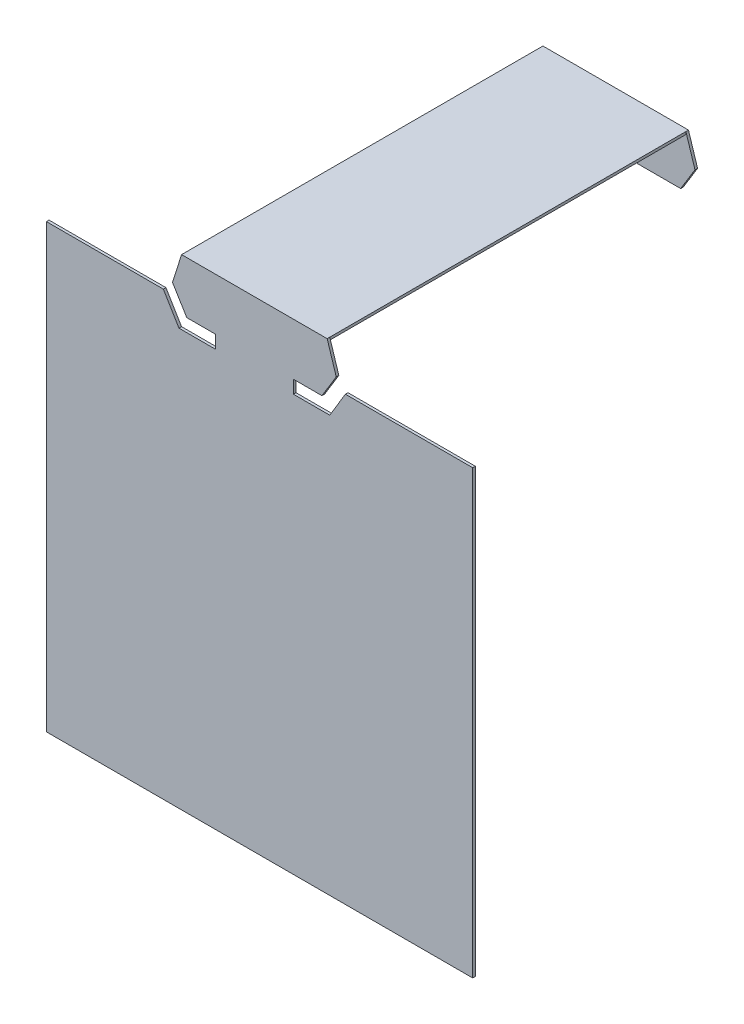
ISO-10303-21;
HEADER;
FILE_DESCRIPTION(('STEP AP214'),'2;1');
FILE_NAME('part.step','',(''),(''),'','','');
FILE_SCHEMA(('AUTOMOTIVE_DESIGN { 1 0 10303 214 1 1 1 1 }'));
ENDSEC;
DATA;
#1=APPLICATION_CONTEXT('core data for automotive mechanical design processes');
#2=APPLICATION_PROTOCOL_DEFINITION('international standard','automotive_design',2000,#1);
#3=PRODUCT_CONTEXT('',#1,'mechanical');
#4=PRODUCT('Part','Part','',(#3));
#5=PRODUCT_RELATED_PRODUCT_CATEGORY('part','',(#4));
#6=PRODUCT_DEFINITION_FORMATION('','',#4);
#7=PRODUCT_DEFINITION_CONTEXT('part definition',#1,'design');
#8=PRODUCT_DEFINITION('design','',#6,#7);
#9=PRODUCT_DEFINITION_SHAPE('','',#8);
#10=(LENGTH_UNIT() NAMED_UNIT(*) SI_UNIT(.MILLI.,.METRE.));
#11=(NAMED_UNIT(*) PLANE_ANGLE_UNIT() SI_UNIT($,.RADIAN.));
#12=(NAMED_UNIT(*) SI_UNIT($,.STERADIAN.) SOLID_ANGLE_UNIT());
#13=UNCERTAINTY_MEASURE_WITH_UNIT(LENGTH_MEASURE(1.E-05),#10,'distance_accuracy_value','');
#14=(GEOMETRIC_REPRESENTATION_CONTEXT(3) GLOBAL_UNCERTAINTY_ASSIGNED_CONTEXT((#13)) GLOBAL_UNIT_ASSIGNED_CONTEXT((#10,
#11,#12)) REPRESENTATION_CONTEXT('',''));
#15=CARTESIAN_POINT('',(0.,0.,0.));
#16=DIRECTION('',(0.,0.,1.));
#17=DIRECTION('',(1.,0.,0.));
#18=AXIS2_PLACEMENT_3D('',#15,#16,#17);
#19=CARTESIAN_POINT('',(-0.3048,2.54,-3.5306));
#20=DIRECTION('',(0.,0.,1.));
#21=DIRECTION('',(1.,0.,0.));
#22=AXIS2_PLACEMENT_3D('',#19,#20,#21);
#23=PLANE('',#22);
#24=DIRECTION('',(0.521450009454707,0.853281833651512,0.));
#25=VECTOR('',#24,1.);
#26=CARTESIAN_POINT('',(0.42545,2.4003,-3.5306));
#27=LINE('',#26,#25);
#28=CARTESIAN_POINT('',(0.355599999999975,2.28600000000001,-3.5306));
#29=VERTEX_POINT('',#28);
#30=CARTESIAN_POINT('',(0.495300000000043,2.51459999999997,-3.5306));
#31=VERTEX_POINT('',#30);
#32=EDGE_CURVE('E214',#29,#31,#27,.T.);
#33=ORIENTED_EDGE('',*,*,#32,.F.);
#34=DIRECTION('',(1.,0.,0.));
#35=VECTOR('',#34,1.);
#36=CARTESIAN_POINT('',(-0.3048,2.286,-3.5306));
#37=LINE('',#36,#35);
#38=CARTESIAN_POINT('',(-0.965199999999975,2.28600000000001,-3.5306));
#39=VERTEX_POINT('',#38);
#40=EDGE_CURVE('E186',#29,#39,#37,.F.);
#41=ORIENTED_EDGE('',*,*,#40,.T.);
#42=DIRECTION('',(-0.521450009454707,0.853281833651512,0.));
#43=VECTOR('',#42,1.);
#44=CARTESIAN_POINT('',(-1.03505,2.4003,-3.5306));
#45=LINE('',#44,#43);
#46=CARTESIAN_POINT('',(-1.10490000000002,2.51459999999998,-3.5306));
#47=VERTEX_POINT('',#46);
#48=EDGE_CURVE('E188',#39,#47,#45,.T.);
#49=ORIENTED_EDGE('',*,*,#48,.T.);
#50=DIRECTION('',(0.303203657275205,0.952925780013816,0.));
#51=VECTOR('',#50,1.);
#52=CARTESIAN_POINT('',(-1.06045000000025,2.6543,-3.5306));
#53=LINE('',#52,#51);
#54=CARTESIAN_POINT('',(-1.01600000000032,2.79400000000002,-3.5306));
#55=VERTEX_POINT('',#54);
#56=EDGE_CURVE('E19',#47,#55,#53,.T.);
#57=ORIENTED_EDGE('',*,*,#56,.T.);
#58=DIRECTION('',(1.,0.,0.));
#59=VECTOR('',#58,1.);
#60=CARTESIAN_POINT('',(-0.3048,2.794,-3.5306));
#61=LINE('',#60,#59);
#62=CARTESIAN_POINT('',(0.406400000000382,2.79400000000004,-3.5306));
#63=VERTEX_POINT('',#62);
#64=EDGE_CURVE('E232',#63,#55,#61,.F.);
#65=ORIENTED_EDGE('',*,*,#64,.F.);
#66=DIRECTION('',(-0.303203657275205,0.952925780013816,0.));
#67=VECTOR('',#66,1.);
#68=CARTESIAN_POINT('',(0.450850000000254,2.6543,-3.5306));
#69=LINE('',#68,#67);
#70=EDGE_CURVE('E219',#31,#63,#69,.T.);
#71=ORIENTED_EDGE('',*,*,#70,.F.);
#72=EDGE_LOOP('',(#33,#41,#49,#57,#65,#71));
#73=FACE_BOUND('',#72,.T.);
#74=ADVANCED_FACE('F16',(#73),#23,.F.);
#75=CARTESIAN_POINT('',(-1.06045000000025,2.6543,-3.5179));
#76=DIRECTION('',(0.952925780013816,-0.303203657275205,0.));
#77=DIRECTION('',(0.303203657275205,0.952925780013816,0.));
#78=AXIS2_PLACEMENT_3D('',#75,#76,#77);
#79=PLANE('',#78);
#80=DIRECTION('',(0.,0.,1.));
#81=VECTOR('',#80,1.);
#82=CARTESIAN_POINT('',(-1.1049000000001,2.51459999999994,-3.5179));
#83=LINE('',#82,#81);
#84=CARTESIAN_POINT('',(-1.10490000000001,2.51459999999998,-3.5052));
#85=VERTEX_POINT('',#84);
#86=EDGE_CURVE('E195',#47,#85,#83,.T.);
#87=ORIENTED_EDGE('',*,*,#86,.T.);
#88=DIRECTION('',(-0.303203657276159,-0.952925780013513,0.));
#89=VECTOR('',#88,1.);
#90=CARTESIAN_POINT('',(-1.01600000000025,2.794,-3.5052));
#91=LINE('',#90,#89);
#92=CARTESIAN_POINT('',(-1.01600000000029,2.79400000000024,-3.5052));
#93=VERTEX_POINT('',#92);
#94=EDGE_CURVE('E235',#93,#85,#91,.T.);
#95=ORIENTED_EDGE('',*,*,#94,.F.);
#96=DIRECTION('',(0.,0.,1.));
#97=VECTOR('',#96,1.);
#98=CARTESIAN_POINT('',(-1.01600000000025,2.794,-1.7653));
#99=LINE('',#98,#97);
#100=EDGE_CURVE('E200',#55,#93,#99,.T.);
#101=ORIENTED_EDGE('',*,*,#100,.F.);
#102=ORIENTED_EDGE('',*,*,#56,.F.);
#103=EDGE_LOOP('',(#87,#95,#101,#102));
#104=FACE_BOUND('',#103,.T.);
#105=ADVANCED_FACE('F197',(#104),#79,.F.);
#106=CARTESIAN_POINT('',(-1.03505,2.4003,-3.5179));
#107=DIRECTION('',(0.853281833651512,0.521450009454707,0.));
#108=DIRECTION('',(-0.521450009454707,0.853281833651512,0.));
#109=AXIS2_PLACEMENT_3D('',#106,#107,#108);
#110=PLANE('',#109);
#111=DIRECTION('',(0.521450009453974,-0.85328183365196,0.));
#112=VECTOR('',#111,1.);
#113=CARTESIAN_POINT('',(-1.1049,2.5146,-3.5052));
#114=LINE('',#113,#112);
#115=CARTESIAN_POINT('',(-0.965199999999951,2.28600000000003,-3.5052));
#116=VERTEX_POINT('',#115);
#117=EDGE_CURVE('E204',#85,#116,#114,.T.);
#118=ORIENTED_EDGE('',*,*,#117,.F.);
#119=ORIENTED_EDGE('',*,*,#86,.F.);
#120=ORIENTED_EDGE('',*,*,#48,.F.);
#121=DIRECTION('',(0.,0.,1.));
#122=VECTOR('',#121,1.);
#123=CARTESIAN_POINT('',(-0.9652,2.286,-3.5179));
#124=LINE('',#123,#122);
#125=EDGE_CURVE('E207',#39,#116,#124,.T.);
#126=ORIENTED_EDGE('',*,*,#125,.T.);
#127=EDGE_LOOP('',(#118,#119,#120,#126));
#128=FACE_BOUND('',#127,.T.);
#129=ADVANCED_FACE('F202',(#128),#110,.F.);
#130=CARTESIAN_POINT('',(-0.3048,2.286,-3.5179));
#131=DIRECTION('',(0.,1.,0.));
#132=DIRECTION('',(0.,0.,1.));
#133=AXIS2_PLACEMENT_3D('',#130,#131,#132);
#134=PLANE('',#133);
#135=DIRECTION('',(1.,0.,0.));
#136=VECTOR('',#135,1.);
#137=CARTESIAN_POINT('',(-0.3048,2.286,-3.5052));
#138=LINE('',#137,#136);
#139=CARTESIAN_POINT('',(0.355599999999975,2.28600000000001,-3.5052));
#140=VERTEX_POINT('',#139);
#141=EDGE_CURVE('E238',#116,#140,#138,.T.);
#142=ORIENTED_EDGE('',*,*,#141,.F.);
#143=ORIENTED_EDGE('',*,*,#125,.F.);
#144=ORIENTED_EDGE('',*,*,#40,.F.);
#145=DIRECTION('',(0.,0.,1.));
#146=VECTOR('',#145,1.);
#147=CARTESIAN_POINT('',(0.355599999999902,2.28600000000006,-3.5179));
#148=LINE('',#147,#146);
#149=EDGE_CURVE('E211',#140,#29,#148,.F.);
#150=ORIENTED_EDGE('',*,*,#149,.F.);
#151=EDGE_LOOP('',(#142,#143,#144,#150));
#152=FACE_BOUND('',#151,.T.);
#153=ADVANCED_FACE('F697',(#152),#134,.F.);
#154=CARTESIAN_POINT('',(0.42545,2.4003,-3.5179));
#155=DIRECTION('',(0.853281833651512,-0.521450009454707,0.));
#156=DIRECTION('',(0.521450009454707,0.853281833651512,0.));
#157=AXIS2_PLACEMENT_3D('',#154,#155,#156);
#158=PLANE('',#157);
#159=ORIENTED_EDGE('',*,*,#149,.T.);
#160=ORIENTED_EDGE('',*,*,#32,.T.);
#161=DIRECTION('',(0.,0.,1.));
#162=VECTOR('',#161,1.);
#163=CARTESIAN_POINT('',(0.495299999999975,2.51459999999999,-3.5179));
#164=LINE('',#163,#162);
#165=CARTESIAN_POINT('',(0.495300000000043,2.51459999999997,-3.5052));
#166=VERTEX_POINT('',#165);
#167=EDGE_CURVE('E216',#166,#31,#164,.F.);
#168=ORIENTED_EDGE('',*,*,#167,.F.);
#169=DIRECTION('',(0.521450009453974,0.853281833651959,0.));
#170=VECTOR('',#169,1.);
#171=CARTESIAN_POINT('',(0.3556,2.286,-3.5052));
#172=LINE('',#171,#170);
#173=EDGE_CURVE('E241',#140,#166,#172,.T.);
#174=ORIENTED_EDGE('',*,*,#173,.F.);
#175=EDGE_LOOP('',(#159,#160,#168,#174));
#176=FACE_BOUND('',#175,.T.);
#177=ADVANCED_FACE('F687',(#176),#158,.T.);
#178=CARTESIAN_POINT('',(0.450850000000254,2.6543,-3.5179));
#179=DIRECTION('',(0.952925780013816,0.303203657275205,0.));
#180=DIRECTION('',(-0.303203657275205,0.952925780013816,0.));
#181=AXIS2_PLACEMENT_3D('',#178,#179,#180);
#182=PLANE('',#181);
#183=ORIENTED_EDGE('',*,*,#70,.T.);
#184=DIRECTION('',(0.,0.,1.));
#185=VECTOR('',#184,1.);
#186=CARTESIAN_POINT('',(0.406400000000254,2.794,-1.7653));
#187=LINE('',#186,#185);
#188=CARTESIAN_POINT('',(0.40640000000035,2.79400000000004,-3.5052));
#189=VERTEX_POINT('',#188);
#190=EDGE_CURVE('E229',#189,#63,#187,.F.);
#191=ORIENTED_EDGE('',*,*,#190,.F.);
#192=DIRECTION('',(-0.30320365727616,0.952925780013512,0.));
#193=VECTOR('',#192,1.);
#194=CARTESIAN_POINT('',(0.4953,2.5146,-3.5052));
#195=LINE('',#194,#193);
#196=EDGE_CURVE('E244',#166,#189,#195,.T.);
#197=ORIENTED_EDGE('',*,*,#196,.F.);
#198=ORIENTED_EDGE('',*,*,#167,.T.);
#199=EDGE_LOOP('',(#183,#191,#197,#198));
#200=FACE_BOUND('',#199,.T.);
#201=ADVANCED_FACE('F678',(#200),#182,.T.);
#202=CARTESIAN_POINT('',(-0.3048,2.794,-1.7653));
#203=DIRECTION('',(0.,1.,0.));
#204=DIRECTION('',(0.,0.,1.));
#205=AXIS2_PLACEMENT_3D('',#202,#203,#204);
#206=PLANE('',#205);
#207=ORIENTED_EDGE('',*,*,#64,.T.);
#208=ORIENTED_EDGE('',*,*,#100,.T.);
#209=DIRECTION('',(0.,0.,-1.));
#210=VECTOR('',#209,1.);
#211=CARTESIAN_POINT('',(-1.016,2.794,-1.7653));
#212=LINE('',#211,#210);
#213=CARTESIAN_POINT('',(-1.01600000000019,2.79400000000011,-0.0254000000000001));
#214=VERTEX_POINT('',#213);
#215=EDGE_CURVE('E250',#93,#214,#212,.F.);
#216=ORIENTED_EDGE('',*,*,#215,.T.);
#217=DIRECTION('',(0.,0.,1.));
#218=VECTOR('',#217,1.);
#219=CARTESIAN_POINT('',(-1.01600000000025,2.794,-1.7653));
#220=LINE('',#219,#218);
#221=CARTESIAN_POINT('',(-1.01600000000032,2.79400000000002,0.));
#222=VERTEX_POINT('',#221);
#223=EDGE_CURVE('E221',#214,#222,#220,.T.);
#224=ORIENTED_EDGE('',*,*,#223,.T.);
#225=DIRECTION('',(1.,0.,0.));
#226=VECTOR('',#225,1.);
#227=CARTESIAN_POINT('',(-0.3048,2.794,0.));
#228=LINE('',#227,#226);
#229=CARTESIAN_POINT('',(0.406400000000312,2.79400000000004,0.));
#230=VERTEX_POINT('',#229);
#231=EDGE_CURVE('E224',#222,#230,#228,.T.);
#232=ORIENTED_EDGE('',*,*,#231,.T.);
#233=DIRECTION('',(0.,0.,1.));
#234=VECTOR('',#233,1.);
#235=CARTESIAN_POINT('',(0.406400000000254,2.794,-1.7653));
#236=LINE('',#235,#234);
#237=CARTESIAN_POINT('',(0.406400000000061,2.79400000000002,-0.0254000000000001));
#238=VERTEX_POINT('',#237);
#239=EDGE_CURVE('E227',#230,#238,#236,.F.);
#240=ORIENTED_EDGE('',*,*,#239,.T.);
#241=DIRECTION('',(0.,0.,-1.));
#242=VECTOR('',#241,1.);
#243=CARTESIAN_POINT('',(0.4064,2.794,-1.7653));
#244=LINE('',#243,#242);
#245=EDGE_CURVE('E255',#189,#238,#244,.F.);
#246=ORIENTED_EDGE('',*,*,#245,.F.);
#247=ORIENTED_EDGE('',*,*,#190,.T.);
#248=EDGE_LOOP('',(#207,#208,#216,#224,#232,#240,#246,#247));
#249=FACE_BOUND('',#248,.T.);
#250=ADVANCED_FACE('F463',(#249),#206,.T.);
#251=CARTESIAN_POINT('',(-0.3048,2.54,-3.5052));
#252=DIRECTION('',(0.,0.,1.));
#253=DIRECTION('',(1.,0.,0.));
#254=AXIS2_PLACEMENT_3D('',#251,#252,#253);
#255=PLANE('',#254);
#256=DIRECTION('',(0.,1.,0.));
#257=VECTOR('',#256,1.);
#258=CARTESIAN_POINT('',(0.4064,2.7813,-3.5052));
#259=LINE('',#258,#257);
#260=CARTESIAN_POINT('',(0.406400000000127,2.7686,-3.5052));
#261=VERTEX_POINT('',#260);
#262=EDGE_CURVE('E260',#261,#189,#259,.T.);
#263=ORIENTED_EDGE('',*,*,#262,.F.);
#264=DIRECTION('',(1.,0.,0.));
#265=VECTOR('',#264,1.);
#266=CARTESIAN_POINT('',(-0.3048,2.7686,-3.5052));
#267=LINE('',#266,#265);
#268=CARTESIAN_POINT('',(-1.016,2.7686,-3.5052));
#269=VERTEX_POINT('',#268);
#270=EDGE_CURVE('E263',#261,#269,#267,.F.);
#271=ORIENTED_EDGE('',*,*,#270,.T.);
#272=DIRECTION('',(0.,1.,0.));
#273=VECTOR('',#272,1.);
#274=CARTESIAN_POINT('',(-1.016,2.7813,-3.5052));
#275=LINE('',#274,#273);
#276=EDGE_CURVE('E247',#269,#93,#275,.T.);
#277=ORIENTED_EDGE('',*,*,#276,.T.);
#278=ORIENTED_EDGE('',*,*,#94,.T.);
#279=ORIENTED_EDGE('',*,*,#117,.T.);
#280=ORIENTED_EDGE('',*,*,#141,.T.);
#281=ORIENTED_EDGE('',*,*,#173,.T.);
#282=ORIENTED_EDGE('',*,*,#196,.T.);
#283=EDGE_LOOP('',(#263,#271,#277,#278,#279,#280,#281,#282));
#284=FACE_BOUND('',#283,.T.);
#285=ADVANCED_FACE('F474',(#284),#255,.T.);
#286=CARTESIAN_POINT('',(-1.016,2.7813,-1.7653));
#287=DIRECTION('',(1.,0.,0.));
#288=DIRECTION('',(0.,0.,-1.));
#289=AXIS2_PLACEMENT_3D('',#286,#287,#288);
#290=PLANE('',#289);
#291=DIRECTION('',(0.,1.,0.));
#292=VECTOR('',#291,1.);
#293=CARTESIAN_POINT('',(-1.016,2.7813,-0.0254000000000001));
#294=LINE('',#293,#292);
#295=CARTESIAN_POINT('',(-1.016,2.7686,-0.0254000000000001));
#296=VERTEX_POINT('',#295);
#297=EDGE_CURVE('E253',#214,#296,#294,.F.);
#298=ORIENTED_EDGE('',*,*,#297,.F.);
#299=ORIENTED_EDGE('',*,*,#215,.F.);
#300=ORIENTED_EDGE('',*,*,#276,.F.);
#301=DIRECTION('',(0.,0.,1.));
#302=VECTOR('',#301,1.);
#303=CARTESIAN_POINT('',(-1.016,2.7686,-1.7653));
#304=LINE('',#303,#302);
#305=EDGE_CURVE('E265',#269,#296,#304,.T.);
#306=ORIENTED_EDGE('',*,*,#305,.T.);
#307=EDGE_LOOP('',(#298,#299,#300,#306));
#308=FACE_BOUND('',#307,.T.);
#309=ADVANCED_FACE('F478',(#308),#290,.F.);
#310=CARTESIAN_POINT('',(0.4064,2.7813,-1.7653));
#311=DIRECTION('',(1.,0.,0.));
#312=DIRECTION('',(0.,0.,-1.));
#313=AXIS2_PLACEMENT_3D('',#310,#311,#312);
#314=PLANE('',#313);
#315=DIRECTION('',(0.,0.,1.));
#316=VECTOR('',#315,1.);
#317=CARTESIAN_POINT('',(0.4064,2.7686,-1.7653));
#318=LINE('',#317,#316);
#319=CARTESIAN_POINT('',(0.4064,2.7686,-0.0254000000000001));
#320=VERTEX_POINT('',#319);
#321=EDGE_CURVE('E268',#320,#261,#318,.F.);
#322=ORIENTED_EDGE('',*,*,#321,.T.);
#323=ORIENTED_EDGE('',*,*,#262,.T.);
#324=ORIENTED_EDGE('',*,*,#245,.T.);
#325=DIRECTION('',(0.,1.,0.));
#326=VECTOR('',#325,1.);
#327=CARTESIAN_POINT('',(0.4064,2.7813,-0.0254000000000001));
#328=LINE('',#327,#326);
#329=EDGE_CURVE('E258',#238,#320,#328,.F.);
#330=ORIENTED_EDGE('',*,*,#329,.T.);
#331=EDGE_LOOP('',(#322,#323,#324,#330));
#332=FACE_BOUND('',#331,.T.);
#333=ADVANCED_FACE('F467',(#332),#314,.T.);
#334=CARTESIAN_POINT('',(-0.3048,2.7686,-1.7653));
#335=DIRECTION('',(0.,1.,0.));
#336=DIRECTION('',(0.,0.,1.));
#337=AXIS2_PLACEMENT_3D('',#334,#335,#336);
#338=PLANE('',#337);
#339=DIRECTION('',(1.,0.,0.));
#340=VECTOR('',#339,1.);
#341=CARTESIAN_POINT('',(-0.254,2.7686,-0.0254));
#342=LINE('',#341,#340);
#343=EDGE_CURVE('E271',#320,#296,#342,.F.);
#344=ORIENTED_EDGE('',*,*,#343,.T.);
#345=ORIENTED_EDGE('',*,*,#305,.F.);
#346=ORIENTED_EDGE('',*,*,#270,.F.);
#347=ORIENTED_EDGE('',*,*,#321,.F.);
#348=EDGE_LOOP('',(#344,#345,#346,#347));
#349=FACE_BOUND('',#348,.T.);
#350=ADVANCED_FACE('F470',(#349),#338,.F.);
#351=CARTESIAN_POINT('',(-0.254,0.4445,-0.0254));
#352=DIRECTION('',(0.,0.,1.));
#353=DIRECTION('',(1.,0.,0.));
#354=AXIS2_PLACEMENT_3D('',#351,#352,#353);
#355=PLANE('',#354);
#356=DIRECTION('',(-0.303203657276947,0.952925780013262,0.));
#357=VECTOR('',#356,1.);
#358=CARTESIAN_POINT('',(0.4953,2.5146,-0.0254));
#359=LINE('',#358,#357);
#360=CARTESIAN_POINT('',(0.495300000000018,2.51459999999998,-0.0254));
#361=VERTEX_POINT('',#360);
#362=EDGE_CURVE('E296',#361,#238,#359,.T.);
#363=ORIENTED_EDGE('',*,*,#362,.F.);
#364=DIRECTION('',(0.521450009453974,0.853281833651959,0.));
#365=VECTOR('',#364,1.);
#366=CARTESIAN_POINT('',(0.3556,2.286,-0.0254));
#367=LINE('',#366,#365);
#368=CARTESIAN_POINT('',(0.355599999999975,2.28600000000001,-0.0254));
#369=VERTEX_POINT('',#368);
#370=EDGE_CURVE('E294',#369,#361,#367,.T.);
#371=ORIENTED_EDGE('',*,*,#370,.F.);
#372=DIRECTION('',(1.,0.,0.));
#373=VECTOR('',#372,1.);
#374=CARTESIAN_POINT('',(-0.254,2.286,-0.0254));
#375=LINE('',#374,#373);
#376=CARTESIAN_POINT('',(0.0762,2.286,-0.0254));
#377=VERTEX_POINT('',#376);
#378=EDGE_CURVE('E292',#377,#369,#375,.T.);
#379=ORIENTED_EDGE('',*,*,#378,.F.);
#380=DIRECTION('',(0.,1.,0.));
#381=VECTOR('',#380,1.);
#382=CARTESIAN_POINT('',(0.0762,0.4445,-0.0254));
#383=LINE('',#382,#381);
#384=CARTESIAN_POINT('',(0.0762,2.159,-0.0254));
#385=VERTEX_POINT('',#384);
#386=EDGE_CURVE('E290',#385,#377,#383,.T.);
#387=ORIENTED_EDGE('',*,*,#386,.F.);
#388=DIRECTION('',(1.,0.,0.));
#389=VECTOR('',#388,1.);
#390=CARTESIAN_POINT('',(-0.254,2.159,-0.0254));
#391=LINE('',#390,#389);
#392=CARTESIAN_POINT('',(0.431800000000009,2.15899999999999,-0.0254));
#393=VERTEX_POINT('',#392);
#394=EDGE_CURVE('E288',#393,#385,#391,.F.);
#395=ORIENTED_EDGE('',*,*,#394,.F.);
#396=DIRECTION('',(-0.514495755427527,-0.857492925712544,0.));
#397=VECTOR('',#396,1.);
#398=CARTESIAN_POINT('',(0.5842,2.413,-0.0254));
#399=LINE('',#398,#397);
#400=CARTESIAN_POINT('',(0.584199999999991,2.41300000000001,-0.0254));
#401=VERTEX_POINT('',#400);
#402=EDGE_CURVE('E286',#401,#393,#399,.T.);
#403=ORIENTED_EDGE('',*,*,#402,.F.);
#404=DIRECTION('',(1.,0.,0.));
#405=VECTOR('',#404,1.);
#406=CARTESIAN_POINT('',(-0.254,2.413,-0.0254));
#407=LINE('',#406,#405);
#408=CARTESIAN_POINT('',(1.8288,2.413,-0.0254));
#409=VERTEX_POINT('',#408);
#410=EDGE_CURVE('E284',#409,#401,#407,.F.);
#411=ORIENTED_EDGE('',*,*,#410,.F.);
#412=DIRECTION('',(0.,1.,0.));
#413=VECTOR('',#412,1.);
#414=CARTESIAN_POINT('',(1.8288,0.254,-0.0254));
#415=LINE('',#414,#413);
#416=CARTESIAN_POINT('',(1.8288,-1.905,-0.0254));
#417=VERTEX_POINT('',#416);
#418=EDGE_CURVE('E318',#417,#409,#415,.T.);
#419=ORIENTED_EDGE('',*,*,#418,.F.);
#420=DIRECTION('',(1.,0.,0.));
#421=VECTOR('',#420,1.);
#422=CARTESIAN_POINT('',(-0.254,-1.905,-0.0254));
#423=LINE('',#422,#421);
#424=CARTESIAN_POINT('',(-2.3368,-1.905,-0.0254));
#425=VERTEX_POINT('',#424);
#426=EDGE_CURVE('E311',#417,#425,#423,.F.);
#427=ORIENTED_EDGE('',*,*,#426,.T.);
#428=DIRECTION('',(0.,1.,0.));
#429=VECTOR('',#428,1.);
#430=CARTESIAN_POINT('',(-2.3368,0.254,-0.0254));
#431=LINE('',#430,#429);
#432=CARTESIAN_POINT('',(-2.3368,2.413,-0.0254));
#433=VERTEX_POINT('',#432);
#434=EDGE_CURVE('E307',#425,#433,#431,.T.);
#435=ORIENTED_EDGE('',*,*,#434,.T.);
#436=DIRECTION('',(1.,0.,0.));
#437=VECTOR('',#436,1.);
#438=CARTESIAN_POINT('',(-1.7653,2.413,-0.0254));
#439=LINE('',#438,#437);
#440=CARTESIAN_POINT('',(-1.19379999999998,2.41300000000001,-0.0254));
#441=VERTEX_POINT('',#440);
#442=EDGE_CURVE('E304',#441,#433,#439,.F.);
#443=ORIENTED_EDGE('',*,*,#442,.F.);
#444=DIRECTION('',(-0.514495755427291,0.857492925712685,0.));
#445=VECTOR('',#444,1.);
#446=CARTESIAN_POINT('',(-1.1176,2.286,-0.0254));
#447=LINE('',#446,#445);
#448=CARTESIAN_POINT('',(-1.04140000000001,2.15899999999999,-0.0254));
#449=VERTEX_POINT('',#448);
#450=EDGE_CURVE('E299',#449,#441,#447,.T.);
#451=ORIENTED_EDGE('',*,*,#450,.F.);
#452=DIRECTION('',(1.,0.,0.));
#453=VECTOR('',#452,1.);
#454=CARTESIAN_POINT('',(-0.254,2.159,-0.0254));
#455=LINE('',#454,#453);
#456=CARTESIAN_POINT('',(-0.6858,2.159,-0.0254));
#457=VERTEX_POINT('',#456);
#458=EDGE_CURVE('E282',#457,#449,#455,.F.);
#459=ORIENTED_EDGE('',*,*,#458,.F.);
#460=DIRECTION('',(0.,1.,0.));
#461=VECTOR('',#460,1.);
#462=CARTESIAN_POINT('',(-0.6858,0.4445,-0.0254));
#463=LINE('',#462,#461);
#464=CARTESIAN_POINT('',(-0.6858,2.286,-0.0254));
#465=VERTEX_POINT('',#464);
#466=EDGE_CURVE('E280',#465,#457,#463,.F.);
#467=ORIENTED_EDGE('',*,*,#466,.F.);
#468=DIRECTION('',(1.,0.,0.));
#469=VECTOR('',#468,1.);
#470=CARTESIAN_POINT('',(-0.254,2.286,-0.0254));
#471=LINE('',#470,#469);
#472=CARTESIAN_POINT('',(-0.965199999999975,2.28600000000001,-0.0254));
#473=VERTEX_POINT('',#472);
#474=EDGE_CURVE('E278',#473,#465,#471,.T.);
#475=ORIENTED_EDGE('',*,*,#474,.F.);
#476=DIRECTION('',(0.521450009453974,-0.85328183365196,0.));
#477=VECTOR('',#476,1.);
#478=CARTESIAN_POINT('',(-1.1049,2.5146,-0.0254));
#479=LINE('',#478,#477);
#480=CARTESIAN_POINT('',(-1.10490000000002,2.51459999999998,-0.0254));
#481=VERTEX_POINT('',#480);
#482=EDGE_CURVE('E276',#481,#473,#479,.T.);
#483=ORIENTED_EDGE('',*,*,#482,.F.);
#484=DIRECTION('',(-0.303203657276159,-0.952925780013513,0.));
#485=VECTOR('',#484,1.);
#486=CARTESIAN_POINT('',(-1.01600000000025,2.794,-0.0254));
#487=LINE('',#486,#485);
#488=EDGE_CURVE('E274',#214,#481,#487,.T.);
#489=ORIENTED_EDGE('',*,*,#488,.F.);
#490=ORIENTED_EDGE('',*,*,#297,.T.);
#491=ORIENTED_EDGE('',*,*,#343,.F.);
#492=ORIENTED_EDGE('',*,*,#329,.F.);
#493=EDGE_LOOP('',(#363,#371,#379,#387,#395,#403,#411,#419,#427,#435,#443,#451,#459,#467,#475,
#483,#489,#490,#491,#492));
#494=FACE_BOUND('',#493,.T.);
#495=ADVANCED_FACE('F407',(#494),#355,.F.);
#496=CARTESIAN_POINT('',(-1.1176,2.286,-0.0127));
#497=DIRECTION('',(0.857492925712685,0.514495755427291,0.));
#498=DIRECTION('',(-0.514495755427291,0.857492925712685,0.));
#499=AXIS2_PLACEMENT_3D('',#496,#497,#498);
#500=PLANE('',#499);
#501=DIRECTION('',(0.,0.,1.));
#502=VECTOR('',#501,1.);
#503=CARTESIAN_POINT('',(-1.1938,2.413,-0.0127));
#504=LINE('',#503,#502);
#505=CARTESIAN_POINT('',(-1.19379999999998,2.41300000000001,0.));
#506=VERTEX_POINT('',#505);
#507=EDGE_CURVE('E301',#506,#441,#504,.F.);
#508=ORIENTED_EDGE('',*,*,#507,.F.);
#509=DIRECTION('',(-0.514495755427528,0.857492925712543,0.));
#510=VECTOR('',#509,1.);
#511=CARTESIAN_POINT('',(-1.0414,2.159,0.));
#512=LINE('',#511,#510);
#513=CARTESIAN_POINT('',(-1.04140000000002,2.15899999999999,0.));
#514=VERTEX_POINT('',#513);
#515=EDGE_CURVE('E350',#514,#506,#512,.T.);
#516=ORIENTED_EDGE('',*,*,#515,.F.);
#517=DIRECTION('',(0.,0.,1.));
#518=VECTOR('',#517,1.);
#519=CARTESIAN_POINT('',(-1.0414,2.159,-0.0127));
#520=LINE('',#519,#518);
#521=EDGE_CURVE('E346',#449,#514,#520,.T.);
#522=ORIENTED_EDGE('',*,*,#521,.F.);
#523=ORIENTED_EDGE('',*,*,#450,.T.);
#524=EDGE_LOOP('',(#508,#516,#522,#523));
#525=FACE_BOUND('',#524,.T.);
#526=ADVANCED_FACE('F415',(#525),#500,.T.);
#527=CARTESIAN_POINT('',(-1.7653,2.413,-0.0127));
#528=DIRECTION('',(0.,1.,0.));
#529=DIRECTION('',(0.,0.,1.));
#530=AXIS2_PLACEMENT_3D('',#527,#528,#529);
#531=PLANE('',#530);
#532=DIRECTION('',(0.,0.,-1.));
#533=VECTOR('',#532,1.);
#534=CARTESIAN_POINT('',(-2.3368,2.413,-0.0127));
#535=LINE('',#534,#533);
#536=CARTESIAN_POINT('',(-2.3368,2.413,0.));
#537=VERTEX_POINT('',#536);
#538=EDGE_CURVE('E309',#433,#537,#535,.F.);
#539=ORIENTED_EDGE('',*,*,#538,.T.);
#540=DIRECTION('',(1.,0.,0.));
#541=VECTOR('',#540,1.);
#542=CARTESIAN_POINT('',(-0.254,2.413,0.));
#543=LINE('',#542,#541);
#544=EDGE_CURVE('E353',#506,#537,#543,.F.);
#545=ORIENTED_EDGE('',*,*,#544,.F.);
#546=ORIENTED_EDGE('',*,*,#507,.T.);
#547=ORIENTED_EDGE('',*,*,#442,.T.);
#548=EDGE_LOOP('',(#539,#545,#546,#547));
#549=FACE_BOUND('',#548,.T.);
#550=ADVANCED_FACE('F419',(#549),#531,.T.);
#551=CARTESIAN_POINT('',(-2.3368,0.254,-0.0127));
#552=DIRECTION('',(1.,0.,0.));
#553=DIRECTION('',(0.,0.,-1.));
#554=AXIS2_PLACEMENT_3D('',#551,#552,#553);
#555=PLANE('',#554);
#556=ORIENTED_EDGE('',*,*,#434,.F.);
#557=DIRECTION('',(0.,0.,1.));
#558=VECTOR('',#557,1.);
#559=CARTESIAN_POINT('',(-2.3368,-1.905,-0.0127));
#560=LINE('',#559,#558);
#561=CARTESIAN_POINT('',(-2.3368,-1.905,0.));
#562=VERTEX_POINT('',#561);
#563=EDGE_CURVE('E313',#425,#562,#560,.T.);
#564=ORIENTED_EDGE('',*,*,#563,.T.);
#565=DIRECTION('',(0.,1.,0.));
#566=VECTOR('',#565,1.);
#567=CARTESIAN_POINT('',(-2.3368,0.4445,0.));
#568=LINE('',#567,#566);
#569=EDGE_CURVE('E356',#537,#562,#568,.F.);
#570=ORIENTED_EDGE('',*,*,#569,.F.);
#571=ORIENTED_EDGE('',*,*,#538,.F.);
#572=EDGE_LOOP('',(#556,#564,#570,#571));
#573=FACE_BOUND('',#572,.T.);
#574=ADVANCED_FACE('F423',(#573),#555,.F.);
#575=CARTESIAN_POINT('',(-0.254,-1.905,-0.0127));
#576=DIRECTION('',(0.,1.,0.));
#577=DIRECTION('',(0.,0.,1.));
#578=AXIS2_PLACEMENT_3D('',#575,#576,#577);
#579=PLANE('',#578);
#580=ORIENTED_EDGE('',*,*,#426,.F.);
#581=DIRECTION('',(0.,0.,-1.));
#582=VECTOR('',#581,1.);
#583=CARTESIAN_POINT('',(1.8288,-1.905,-0.0127));
#584=LINE('',#583,#582);
#585=CARTESIAN_POINT('',(1.8288,-1.905,0.));
#586=VERTEX_POINT('',#585);
#587=EDGE_CURVE('E315',#586,#417,#584,.T.);
#588=ORIENTED_EDGE('',*,*,#587,.F.);
#589=DIRECTION('',(1.,0.,0.));
#590=VECTOR('',#589,1.);
#591=CARTESIAN_POINT('',(-0.254,-1.905,0.));
#592=LINE('',#591,#590);
#593=EDGE_CURVE('E359',#562,#586,#592,.T.);
#594=ORIENTED_EDGE('',*,*,#593,.F.);
#595=ORIENTED_EDGE('',*,*,#563,.F.);
#596=EDGE_LOOP('',(#580,#588,#594,#595));
#597=FACE_BOUND('',#596,.T.);
#598=ADVANCED_FACE('F427',(#597),#579,.F.);
#599=CARTESIAN_POINT('',(1.8288,0.254,-0.0127));
#600=DIRECTION('',(1.,0.,0.));
#601=DIRECTION('',(0.,0.,-1.));
#602=AXIS2_PLACEMENT_3D('',#599,#600,#601);
#603=PLANE('',#602);
#604=DIRECTION('',(0.,0.,1.));
#605=VECTOR('',#604,1.);
#606=CARTESIAN_POINT('',(1.8288,2.413,-0.0127));
#607=LINE('',#606,#605);
#608=CARTESIAN_POINT('',(1.8288,2.413,0.));
#609=VERTEX_POINT('',#608);
#610=EDGE_CURVE('E321',#609,#409,#607,.F.);
#611=ORIENTED_EDGE('',*,*,#610,.F.);
#612=DIRECTION('',(0.,1.,0.));
#613=VECTOR('',#612,1.);
#614=CARTESIAN_POINT('',(1.8288,0.4445,0.));
#615=LINE('',#614,#613);
#616=EDGE_CURVE('E362',#586,#609,#615,.T.);
#617=ORIENTED_EDGE('',*,*,#616,.F.);
#618=ORIENTED_EDGE('',*,*,#587,.T.);
#619=ORIENTED_EDGE('',*,*,#418,.T.);
#620=EDGE_LOOP('',(#611,#617,#618,#619));
#621=FACE_BOUND('',#620,.T.);
#622=ADVANCED_FACE('F431',(#621),#603,.T.);
#623=CARTESIAN_POINT('',(1.2065,2.413,-0.0127));
#624=DIRECTION('',(0.,1.,0.));
#625=DIRECTION('',(0.,0.,1.));
#626=AXIS2_PLACEMENT_3D('',#623,#624,#625);
#627=PLANE('',#626);
#628=DIRECTION('',(0.,0.,1.));
#629=VECTOR('',#628,1.);
#630=CARTESIAN_POINT('',(0.584199999999965,2.41300000000002,-0.0127));
#631=LINE('',#630,#629);
#632=CARTESIAN_POINT('',(0.584199999999991,2.41300000000001,0.));
#633=VERTEX_POINT('',#632);
#634=EDGE_CURVE('E324',#401,#633,#631,.T.);
#635=ORIENTED_EDGE('',*,*,#634,.T.);
#636=DIRECTION('',(1.,0.,0.));
#637=VECTOR('',#636,1.);
#638=CARTESIAN_POINT('',(-0.254,2.413,0.));
#639=LINE('',#638,#637);
#640=EDGE_CURVE('E365',#609,#633,#639,.F.);
#641=ORIENTED_EDGE('',*,*,#640,.F.);
#642=ORIENTED_EDGE('',*,*,#610,.T.);
#643=ORIENTED_EDGE('',*,*,#410,.T.);
#644=EDGE_LOOP('',(#635,#641,#642,#643));
#645=FACE_BOUND('',#644,.T.);
#646=ADVANCED_FACE('F434',(#645),#627,.T.);
#647=CARTESIAN_POINT('',(0.508,2.286,-0.0127));
#648=DIRECTION('',(0.857492925712685,-0.514495755427291,0.));
#649=DIRECTION('',(0.514495755427291,0.857492925712685,0.));
#650=AXIS2_PLACEMENT_3D('',#647,#648,#649);
#651=PLANE('',#650);
#652=ORIENTED_EDGE('',*,*,#402,.T.);
#653=DIRECTION('',(0.,0.,1.));
#654=VECTOR('',#653,1.);
#655=CARTESIAN_POINT('',(0.4318,2.159,-0.0127));
#656=LINE('',#655,#654);
#657=CARTESIAN_POINT('',(0.431800000000018,2.15899999999999,0.));
#658=VERTEX_POINT('',#657);
#659=EDGE_CURVE('E326',#658,#393,#656,.F.);
#660=ORIENTED_EDGE('',*,*,#659,.F.);
#661=DIRECTION('',(-0.514495755427527,-0.857492925712544,0.));
#662=VECTOR('',#661,1.);
#663=CARTESIAN_POINT('',(0.5842,2.413,0.));
#664=LINE('',#663,#662);
#665=EDGE_CURVE('E368',#633,#658,#664,.T.);
#666=ORIENTED_EDGE('',*,*,#665,.F.);
#667=ORIENTED_EDGE('',*,*,#634,.F.);
#668=EDGE_LOOP('',(#652,#660,#666,#667));
#669=FACE_BOUND('',#668,.T.);
#670=ADVANCED_FACE('F439',(#669),#651,.F.);
#671=CARTESIAN_POINT('',(0.254,2.159,-0.0127));
#672=DIRECTION('',(0.,1.,0.));
#673=DIRECTION('',(0.,0.,1.));
#674=AXIS2_PLACEMENT_3D('',#671,#672,#673);
#675=PLANE('',#674);
#676=ORIENTED_EDGE('',*,*,#394,.T.);
#677=DIRECTION('',(0.,0.,-1.));
#678=VECTOR('',#677,1.);
#679=CARTESIAN_POINT('',(0.0762,2.159,-0.0127));
#680=LINE('',#679,#678);
#681=CARTESIAN_POINT('',(0.0762,2.159,0.));
#682=VERTEX_POINT('',#681);
#683=EDGE_CURVE('E329',#682,#385,#680,.T.);
#684=ORIENTED_EDGE('',*,*,#683,.F.);
#685=DIRECTION('',(1.,0.,0.));
#686=VECTOR('',#685,1.);
#687=CARTESIAN_POINT('',(-0.254,2.159,0.));
#688=LINE('',#687,#686);
#689=EDGE_CURVE('E371',#658,#682,#688,.F.);
#690=ORIENTED_EDGE('',*,*,#689,.F.);
#691=ORIENTED_EDGE('',*,*,#659,.T.);
#692=EDGE_LOOP('',(#676,#684,#690,#691));
#693=FACE_BOUND('',#692,.T.);
#694=ADVANCED_FACE('F443',(#693),#675,.T.);
#695=CARTESIAN_POINT('',(0.0762,2.2225,-0.0127));
#696=DIRECTION('',(1.,0.,0.));
#697=DIRECTION('',(0.,0.,-1.));
#698=AXIS2_PLACEMENT_3D('',#695,#696,#697);
#699=PLANE('',#698);
#700=DIRECTION('',(0.,1.,0.));
#701=VECTOR('',#700,1.);
#702=CARTESIAN_POINT('',(0.0762,0.4445,0.));
#703=LINE('',#702,#701);
#704=CARTESIAN_POINT('',(0.0762,2.286,0.));
#705=VERTEX_POINT('',#704);
#706=EDGE_CURVE('E374',#682,#705,#703,.T.);
#707=ORIENTED_EDGE('',*,*,#706,.F.);
#708=ORIENTED_EDGE('',*,*,#683,.T.);
#709=ORIENTED_EDGE('',*,*,#386,.T.);
#710=DIRECTION('',(0.,0.,1.));
#711=VECTOR('',#710,1.);
#712=CARTESIAN_POINT('',(0.0762,2.286,-0.0127));
#713=LINE('',#712,#711);
#714=EDGE_CURVE('E332',#377,#705,#713,.T.);
#715=ORIENTED_EDGE('',*,*,#714,.T.);
#716=EDGE_LOOP('',(#707,#708,#709,#715));
#717=FACE_BOUND('',#716,.T.);
#718=ADVANCED_FACE('F447',(#717),#699,.T.);
#719=CARTESIAN_POINT('',(0.2159,2.286,-0.0127));
#720=DIRECTION('',(0.,1.,0.));
#721=DIRECTION('',(0.,0.,1.));
#722=AXIS2_PLACEMENT_3D('',#719,#720,#721);
#723=PLANE('',#722);
#724=ORIENTED_EDGE('',*,*,#378,.T.);
#725=DIRECTION('',(0.,0.,1.));
#726=VECTOR('',#725,1.);
#727=CARTESIAN_POINT('',(0.355599999999902,2.28600000000006,-0.0127));
#728=LINE('',#727,#726);
#729=CARTESIAN_POINT('',(0.355599999999975,2.28600000000001,0.));
#730=VERTEX_POINT('',#729);
#731=EDGE_CURVE('E334',#730,#369,#728,.F.);
#732=ORIENTED_EDGE('',*,*,#731,.F.);
#733=DIRECTION('',(1.,0.,0.));
#734=VECTOR('',#733,1.);
#735=CARTESIAN_POINT('',(-0.254,2.286,0.));
#736=LINE('',#735,#734);
#737=EDGE_CURVE('E377',#705,#730,#736,.T.);
#738=ORIENTED_EDGE('',*,*,#737,.F.);
#739=ORIENTED_EDGE('',*,*,#714,.F.);
#740=EDGE_LOOP('',(#724,#732,#738,#739));
#741=FACE_BOUND('',#740,.T.);
#742=ADVANCED_FACE('F452',(#741),#723,.F.);
#743=CARTESIAN_POINT('',(0.42545,2.4003,-0.0127));
#744=DIRECTION('',(0.853281833651512,-0.521450009454707,0.));
#745=DIRECTION('',(0.521450009454707,0.853281833651512,0.));
#746=AXIS2_PLACEMENT_3D('',#743,#744,#745);
#747=PLANE('',#746);
#748=DIRECTION('',(0.,0.,1.));
#749=VECTOR('',#748,1.);
#750=CARTESIAN_POINT('',(0.495299999999975,2.51459999999999,-0.0127));
#751=LINE('',#750,#749);
#752=CARTESIAN_POINT('',(0.495300000000043,2.51459999999997,0.));
#753=VERTEX_POINT('',#752);
#754=EDGE_CURVE('E337',#753,#361,#751,.F.);
#755=ORIENTED_EDGE('',*,*,#754,.F.);
#756=DIRECTION('',(0.521450009453974,0.853281833651959,0.));
#757=VECTOR('',#756,1.);
#758=CARTESIAN_POINT('',(0.3556,2.286,0.));
#759=LINE('',#758,#757);
#760=EDGE_CURVE('E380',#730,#753,#759,.T.);
#761=ORIENTED_EDGE('',*,*,#760,.F.);
#762=ORIENTED_EDGE('',*,*,#731,.T.);
#763=ORIENTED_EDGE('',*,*,#370,.T.);
#764=EDGE_LOOP('',(#755,#761,#762,#763));
#765=FACE_BOUND('',#764,.T.);
#766=ADVANCED_FACE('F456',(#765),#747,.T.);
#767=CARTESIAN_POINT('',(0.450850000000254,2.6543,-0.0127));
#768=DIRECTION('',(0.952925780013816,0.303203657275205,0.));
#769=DIRECTION('',(-0.303203657275205,0.952925780013816,0.));
#770=AXIS2_PLACEMENT_3D('',#767,#768,#769);
#771=PLANE('',#770);
#772=ORIENTED_EDGE('',*,*,#754,.T.);
#773=ORIENTED_EDGE('',*,*,#362,.T.);
#774=ORIENTED_EDGE('',*,*,#239,.F.);
#775=DIRECTION('',(-0.30320365727616,0.952925780013512,0.));
#776=VECTOR('',#775,1.);
#777=CARTESIAN_POINT('',(0.4953,2.5146,0.));
#778=LINE('',#777,#776);
#779=EDGE_CURVE('E383',#753,#230,#778,.T.);
#780=ORIENTED_EDGE('',*,*,#779,.F.);
#781=EDGE_LOOP('',(#772,#773,#774,#780));
#782=FACE_BOUND('',#781,.T.);
#783=ADVANCED_FACE('F459',(#782),#771,.T.);
#784=CARTESIAN_POINT('',(-1.06045000000025,2.6543,-0.0127));
#785=DIRECTION('',(0.952925780013816,-0.303203657275205,0.));
#786=DIRECTION('',(0.303203657275205,0.952925780013816,0.));
#787=AXIS2_PLACEMENT_3D('',#784,#785,#786);
#788=PLANE('',#787);
#789=DIRECTION('',(-0.303203657276159,-0.952925780013513,0.));
#790=VECTOR('',#789,1.);
#791=CARTESIAN_POINT('',(-1.01600000000025,2.794,0.));
#792=LINE('',#791,#790);
#793=CARTESIAN_POINT('',(-1.10490000000001,2.51459999999998,0.));
#794=VERTEX_POINT('',#793);
#795=EDGE_CURVE('E386',#222,#794,#792,.T.);
#796=ORIENTED_EDGE('',*,*,#795,.F.);
#797=ORIENTED_EDGE('',*,*,#223,.F.);
#798=ORIENTED_EDGE('',*,*,#488,.T.);
#799=DIRECTION('',(0.,0.,1.));
#800=VECTOR('',#799,1.);
#801=CARTESIAN_POINT('',(-1.1049000000001,2.51459999999994,-0.0127));
#802=LINE('',#801,#800);
#803=EDGE_CURVE('E340',#481,#794,#802,.T.);
#804=ORIENTED_EDGE('',*,*,#803,.T.);
#805=EDGE_LOOP('',(#796,#797,#798,#804));
#806=FACE_BOUND('',#805,.T.);
#807=ADVANCED_FACE('F483',(#806),#788,.F.);
#808=CARTESIAN_POINT('',(-1.03505,2.4003,-0.0127));
#809=DIRECTION('',(0.853281833651512,0.521450009454707,0.));
#810=DIRECTION('',(-0.521450009454707,0.853281833651512,0.));
#811=AXIS2_PLACEMENT_3D('',#808,#809,#810);
#812=PLANE('',#811);
#813=ORIENTED_EDGE('',*,*,#482,.T.);
#814=DIRECTION('',(0.,0.,1.));
#815=VECTOR('',#814,1.);
#816=CARTESIAN_POINT('',(-0.9652,2.286,-0.0127));
#817=LINE('',#816,#815);
#818=CARTESIAN_POINT('',(-0.965199999999951,2.28600000000003,0.));
#819=VERTEX_POINT('',#818);
#820=EDGE_CURVE('E342',#473,#819,#817,.T.);
#821=ORIENTED_EDGE('',*,*,#820,.T.);
#822=DIRECTION('',(0.521450009453974,-0.85328183365196,0.));
#823=VECTOR('',#822,1.);
#824=CARTESIAN_POINT('',(-1.1049,2.5146,0.));
#825=LINE('',#824,#823);
#826=EDGE_CURVE('E389',#794,#819,#825,.T.);
#827=ORIENTED_EDGE('',*,*,#826,.F.);
#828=ORIENTED_EDGE('',*,*,#803,.F.);
#829=EDGE_LOOP('',(#813,#821,#827,#828));
#830=FACE_BOUND('',#829,.T.);
#831=ADVANCED_FACE('F486',(#830),#812,.F.);
#832=CARTESIAN_POINT('',(-0.8255,2.286,-0.0127));
#833=DIRECTION('',(0.,1.,0.));
#834=DIRECTION('',(0.,0.,1.));
#835=AXIS2_PLACEMENT_3D('',#832,#833,#834);
#836=PLANE('',#835);
#837=ORIENTED_EDGE('',*,*,#474,.T.);
#838=DIRECTION('',(0.,0.,-1.));
#839=VECTOR('',#838,1.);
#840=CARTESIAN_POINT('',(-0.6858,2.286,-0.0127));
#841=LINE('',#840,#839);
#842=CARTESIAN_POINT('',(-0.6858,2.286,0.));
#843=VERTEX_POINT('',#842);
#844=EDGE_CURVE('E344',#465,#843,#841,.F.);
#845=ORIENTED_EDGE('',*,*,#844,.T.);
#846=DIRECTION('',(1.,0.,0.));
#847=VECTOR('',#846,1.);
#848=CARTESIAN_POINT('',(-0.254,2.286,0.));
#849=LINE('',#848,#847);
#850=EDGE_CURVE('E392',#819,#843,#849,.T.);
#851=ORIENTED_EDGE('',*,*,#850,.F.);
#852=ORIENTED_EDGE('',*,*,#820,.F.);
#853=EDGE_LOOP('',(#837,#845,#851,#852));
#854=FACE_BOUND('',#853,.T.);
#855=ADVANCED_FACE('F488',(#854),#836,.F.);
#856=CARTESIAN_POINT('',(-0.6858,2.2225,-0.0127));
#857=DIRECTION('',(1.,0.,0.));
#858=DIRECTION('',(0.,0.,-1.));
#859=AXIS2_PLACEMENT_3D('',#856,#857,#858);
#860=PLANE('',#859);
#861=ORIENTED_EDGE('',*,*,#844,.F.);
#862=ORIENTED_EDGE('',*,*,#466,.T.);
#863=DIRECTION('',(0.,0.,1.));
#864=VECTOR('',#863,1.);
#865=CARTESIAN_POINT('',(-0.6858,2.159,-0.0127));
#866=LINE('',#865,#864);
#867=CARTESIAN_POINT('',(-0.6858,2.159,0.));
#868=VERTEX_POINT('',#867);
#869=EDGE_CURVE('E34',#868,#457,#866,.F.);
#870=ORIENTED_EDGE('',*,*,#869,.F.);
#871=DIRECTION('',(0.,1.,0.));
#872=VECTOR('',#871,1.);
#873=CARTESIAN_POINT('',(-0.6858,0.4445,0.));
#874=LINE('',#873,#872);
#875=EDGE_CURVE('E25',#843,#868,#874,.F.);
#876=ORIENTED_EDGE('',*,*,#875,.F.);
#877=EDGE_LOOP('',(#861,#862,#870,#876));
#878=FACE_BOUND('',#877,.T.);
#879=ADVANCED_FACE('F400',(#878),#860,.F.);
#880=CARTESIAN_POINT('',(-0.8636,2.159,-0.0127));
#881=DIRECTION('',(0.,1.,0.));
#882=DIRECTION('',(0.,0.,1.));
#883=AXIS2_PLACEMENT_3D('',#880,#881,#882);
#884=PLANE('',#883);
#885=DIRECTION('',(1.,0.,0.));
#886=VECTOR('',#885,1.);
#887=CARTESIAN_POINT('',(-0.254,2.159,0.));
#888=LINE('',#887,#886);
#889=EDGE_CURVE('E11',#868,#514,#888,.F.);
#890=ORIENTED_EDGE('',*,*,#889,.F.);
#891=ORIENTED_EDGE('',*,*,#869,.T.);
#892=ORIENTED_EDGE('',*,*,#458,.T.);
#893=ORIENTED_EDGE('',*,*,#521,.T.);
#894=EDGE_LOOP('',(#890,#891,#892,#893));
#895=FACE_BOUND('',#894,.T.);
#896=ADVANCED_FACE('F413',(#895),#884,.T.);
#897=CARTESIAN_POINT('',(-0.254,0.4445,0.));
#898=DIRECTION('',(0.,0.,1.));
#899=DIRECTION('',(1.,0.,0.));
#900=AXIS2_PLACEMENT_3D('',#897,#898,#899);
#901=PLANE('',#900);
#902=ORIENTED_EDGE('',*,*,#875,.T.);
#903=ORIENTED_EDGE('',*,*,#889,.T.);
#904=ORIENTED_EDGE('',*,*,#515,.T.);
#905=ORIENTED_EDGE('',*,*,#544,.T.);
#906=ORIENTED_EDGE('',*,*,#569,.T.);
#907=ORIENTED_EDGE('',*,*,#593,.T.);
#908=ORIENTED_EDGE('',*,*,#616,.T.);
#909=ORIENTED_EDGE('',*,*,#640,.T.);
#910=ORIENTED_EDGE('',*,*,#665,.T.);
#911=ORIENTED_EDGE('',*,*,#689,.T.);
#912=ORIENTED_EDGE('',*,*,#706,.T.);
#913=ORIENTED_EDGE('',*,*,#737,.T.);
#914=ORIENTED_EDGE('',*,*,#760,.T.);
#915=ORIENTED_EDGE('',*,*,#779,.T.);
#916=ORIENTED_EDGE('',*,*,#231,.F.);
#917=ORIENTED_EDGE('',*,*,#795,.T.);
#918=ORIENTED_EDGE('',*,*,#826,.T.);
#919=ORIENTED_EDGE('',*,*,#850,.T.);
#920=EDGE_LOOP('',(#902,#903,#904,#905,#906,#907,#908,#909,#910,#911,#912,#913,#914,#915,#916,
#917,#918,#919));
#921=FACE_BOUND('',#920,.T.);
#922=ADVANCED_FACE('F397',(#921),#901,.T.);
#923=CLOSED_SHELL('',(#74,#105,#129,#153,#177,#201,#250,#285,#309,#333,#350,#495,#526,#550,#574,
#598,#622,#646,#670,#694,#718,#742,#766,#783,#807,#831,#855,#879,#896,#922));
#924=MANIFOLD_SOLID_BREP('B1',#923);
#925=ADVANCED_BREP_SHAPE_REPRESENTATION('',(#18,#924),#14);
#926=SHAPE_DEFINITION_REPRESENTATION(#9,#925);
ENDSEC;
END-ISO-10303-21;
